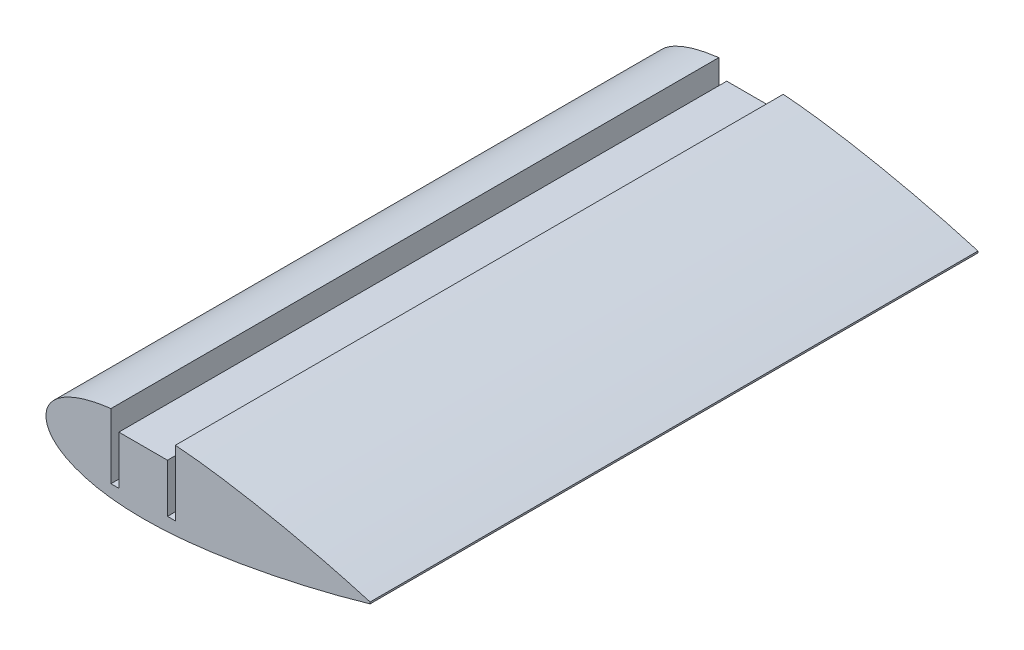
ISO-10303-21;
HEADER;
FILE_DESCRIPTION(('STEP AP214'),'2;1');
FILE_NAME('part.step','',(''),(''),'','','');
FILE_SCHEMA(('AUTOMOTIVE_DESIGN { 1 0 10303 214 1 1 1 1 }'));
ENDSEC;
DATA;
#1=APPLICATION_CONTEXT('core data for automotive mechanical design processes');
#2=APPLICATION_PROTOCOL_DEFINITION('international standard','automotive_design',2000,#1);
#3=PRODUCT_CONTEXT('',#1,'mechanical');
#4=PRODUCT('Part','Part','',(#3));
#5=PRODUCT_RELATED_PRODUCT_CATEGORY('part','',(#4));
#6=PRODUCT_DEFINITION_FORMATION('','',#4);
#7=PRODUCT_DEFINITION_CONTEXT('part definition',#1,'design');
#8=PRODUCT_DEFINITION('design','',#6,#7);
#9=PRODUCT_DEFINITION_SHAPE('','',#8);
#10=(LENGTH_UNIT() NAMED_UNIT(*) SI_UNIT(.MILLI.,.METRE.));
#11=(NAMED_UNIT(*) PLANE_ANGLE_UNIT() SI_UNIT($,.RADIAN.));
#12=(NAMED_UNIT(*) SI_UNIT($,.STERADIAN.) SOLID_ANGLE_UNIT());
#13=UNCERTAINTY_MEASURE_WITH_UNIT(LENGTH_MEASURE(1.E-05),#10,'distance_accuracy_value','');
#14=(GEOMETRIC_REPRESENTATION_CONTEXT(3) GLOBAL_UNCERTAINTY_ASSIGNED_CONTEXT((#13)) GLOBAL_UNIT_ASSIGNED_CONTEXT((#10,
#11,#12)) REPRESENTATION_CONTEXT('',''));
#15=CARTESIAN_POINT('',(0.,0.,0.));
#16=DIRECTION('',(0.,0.,1.));
#17=DIRECTION('',(1.,0.,0.));
#18=AXIS2_PLACEMENT_3D('',#15,#16,#17);
#19=CARTESIAN_POINT('',(55.9989919193493,0.209938863085076,150.));
#20=CARTESIAN_POINT('',(53.4638964966378,0.950455213569446,150.));
#21=CARTESIAN_POINT('',(48.8039042583549,2.23387389684317,150.));
#22=CARTESIAN_POINT('',(42.4289239083546,3.81993488404164,150.));
#23=CARTESIAN_POINT('',(36.7433768309172,5.12087345257297,150.));
#24=CARTESIAN_POINT('',(31.199749361999,6.28724939568446,150.));
#25=CARTESIAN_POINT('',(25.282426202672,7.40748841907212,150.));
#26=CARTESIAN_POINT('',(20.1764843732921,8.24523101459941,150.));
#27=CARTESIAN_POINT('',(14.9796239544358,8.97488730570402,150.));
#28=CARTESIAN_POINT('',(10.821499068855,9.448623319597,150.));
#29=CARTESIAN_POINT('',(6.69735098701538,9.77702289368401,150.));
#30=CARTESIAN_POINT('',(3.68065560441313,9.9396226054484,150.));
#31=CARTESIAN_POINT('',(0.739619612666901,10.0126657259053,150.));
#32=CARTESIAN_POINT('',(-2.10775121270018,9.99002894364164,150.));
#33=CARTESIAN_POINT('',(-4.84394170477697,9.86696098204471,150.));
#34=CARTESIAN_POINT('',(-7.45218804783977,9.64089989695852,150.));
#35=CARTESIAN_POINT('',(-9.91647870541163,9.31063074400066,150.));
#36=CARTESIAN_POINT('',(-12.2217517660549,8.87722299298465,150.));
#37=CARTESIAN_POINT('',(-14.3540217517739,8.3436594333454,150.));
#38=CARTESIAN_POINT('',(-16.3004013447247,7.71434115945919,150.));
#39=CARTESIAN_POINT('',(-18.0493555178327,6.99539951409285,150.));
#40=CARTESIAN_POINT('',(-19.5906051636423,6.19339349001841,150.));
#41=CARTESIAN_POINT('',(-20.9154102376862,5.31556202706807,150.));
#42=CARTESIAN_POINT('',(-22.0158536973899,4.36806482887196,150.));
#43=CARTESIAN_POINT('',(-22.8849211839651,3.3564916522408,150.));
#44=CARTESIAN_POINT('',(-23.5144514570847,2.28497610959955,150.));
#45=CARTESIAN_POINT('',(-23.8953726240987,1.15878899111641,150.));
#46=CARTESIAN_POINT('',(-24.0186796636969,-1.75908521777257E-13,150.));
#47=CARTESIAN_POINT('',(-23.8953726240988,-1.15878899111675,150.));
#48=CARTESIAN_POINT('',(-23.5144514570847,-2.28497610959989,150.));
#49=CARTESIAN_POINT('',(-22.884921183965,-3.35649165224111,150.));
#50=CARTESIAN_POINT('',(-22.0158536973898,-4.36806482887224,150.));
#51=CARTESIAN_POINT('',(-20.915410237686,-5.3155620270683,150.));
#52=CARTESIAN_POINT('',(-19.5906051636421,-6.19339349001866,150.));
#53=CARTESIAN_POINT('',(-18.0493555178326,-6.99539951409303,150.));
#54=CARTESIAN_POINT('',(-16.3004013447245,-7.7143411594593,150.));
#55=CARTESIAN_POINT('',(-14.3540217517738,-8.34365943334548,150.));
#56=CARTESIAN_POINT('',(-12.2217517660546,-8.87722299298468,150.));
#57=CARTESIAN_POINT('',(-9.91647870541153,-9.31063074400058,150.));
#58=CARTESIAN_POINT('',(-7.45218804783928,-9.64089989695837,150.));
#59=CARTESIAN_POINT('',(-4.84394170477671,-9.86696098204449,150.));
#60=CARTESIAN_POINT('',(-2.10775121269992,-9.9900289436414,150.));
#61=CARTESIAN_POINT('',(0.739619612667124,-10.0126657259049,150.));
#62=CARTESIAN_POINT('',(3.68065560441341,-9.93962260544802,150.));
#63=CARTESIAN_POINT('',(7.74070186985012,-9.72078633967261,150.));
#64=CARTESIAN_POINT('',(12.9128329822487,-9.24133423758695,150.));
#65=CARTESIAN_POINT('',(19.1366713132933,-8.41575446947586,150.));
#66=CARTESIAN_POINT('',(25.2824253698515,-7.40744897655412,150.));
#67=CARTESIAN_POINT('',(31.1997526672966,-6.28725230429911,150.));
#68=CARTESIAN_POINT('',(37.5171609466784,-4.95809921986488,150.));
#69=CARTESIAN_POINT('',(44.7425708724751,-3.27585727198836,150.));
#70=CARTESIAN_POINT('',(51.057566094569,-1.62626062854624,150.));
#71=CARTESIAN_POINT('',(54.9450257220016,-0.517808616230064,150.));
#72=CARTESIAN_POINT('',(55.9579115196256,-0.221938690548135,150.));
#73=CARTESIAN_POINT('',(55.9989919193493,-0.209938863083146,150.));
#74=B_SPLINE_CURVE_WITH_KNOTS('',3,(#19,#20,#21,#22,#23,#24,#25,#26,#27,#28,#29,#30,#31,#32,#33,
#34,#35,#36,#37,#38,#39,#40,#41,#42,#43,#44,#45,#46,#47,#48,#49,#50,#51,#52,#53,#54,#55,#56,#57,
#58,#59,#60,#61,#62,#63,#64,#65,#66,#67,#68,#69,#70,#71,#72,#73),.UNSPECIFIED.,.F.,.F.,(4,1,1,1,
1,1,1,1,1,1,1,1,1,1,1,1,1,1,1,1,1,1,1,1,1,1,1,1,1,1,1,1,1,1,1,1,1,1,1,1,1,1,1,1,1,1,1,1,1,1,1,1,
4),(0.,0.046554702548103,0.0851933723553801,0.115793222339596,0.149362634078918,0.1850479898127,
0.221946042476896,0.240561294663547,0.277549679499533,0.295701184971201,0.313482549842361,
0.330796889450606,0.347551895237421,0.36366584186233,0.379065349030513,0.393686065347915,
0.407475418245897,0.42039193375361,0.432405656844922,0.443502805927447,0.45368642125852,
0.462984388050073,0.471455944432899,0.479204464756735,0.48638826860332,0.493228973887645,0.5,
0.506771026112355,0.51361173139668,0.520795535243265,0.528544055567101,0.537015611949927,
0.54631357874148,0.556497194072553,0.567594343155078,0.579608066246389,0.592524581754103,
0.606313934652085,0.620934650969486,0.63633415813767,0.652448104762579,0.669203110549394,
0.686517450157639,0.704298815028799,0.740866340835607,0.778053957523103,0.8149520101873,
0.850637365921082,0.884206777660403,0.928744289385696,0.981399281225805,0.999245596133163,1.),.UNSPECIFIED.);
#75=DIRECTION('',(0.,0.,-1.));
#76=VECTOR('',#75,1.);
#77=SURFACE_OF_LINEAR_EXTRUSION('',#74,#76);
#78=CARTESIAN_POINT('',(55.9989919193493,0.209938863085076,0.));
#79=CARTESIAN_POINT('',(53.4638964966378,0.950455213569446,0.));
#80=CARTESIAN_POINT('',(48.8039042583549,2.23387389684317,0.));
#81=CARTESIAN_POINT('',(42.4289239083546,3.81993488404164,0.));
#82=CARTESIAN_POINT('',(36.7433768309172,5.12087345257297,0.));
#83=CARTESIAN_POINT('',(31.199749361999,6.28724939568446,0.));
#84=CARTESIAN_POINT('',(25.282426202672,7.40748841907212,0.));
#85=CARTESIAN_POINT('',(20.1764843732921,8.24523101459941,0.));
#86=CARTESIAN_POINT('',(14.9796239544358,8.97488730570402,0.));
#87=CARTESIAN_POINT('',(10.821499068855,9.448623319597,0.));
#88=CARTESIAN_POINT('',(6.69735098701538,9.77702289368401,0.));
#89=CARTESIAN_POINT('',(3.68065560441313,9.9396226054484,0.));
#90=CARTESIAN_POINT('',(0.739619612666901,10.0126657259053,0.));
#91=CARTESIAN_POINT('',(-2.10775121270018,9.99002894364164,0.));
#92=CARTESIAN_POINT('',(-4.84394170477697,9.86696098204471,0.));
#93=CARTESIAN_POINT('',(-7.45218804783977,9.64089989695852,0.));
#94=CARTESIAN_POINT('',(-9.91647870541163,9.31063074400066,0.));
#95=CARTESIAN_POINT('',(-12.2217517660549,8.87722299298465,0.));
#96=CARTESIAN_POINT('',(-14.3540217517739,8.3436594333454,0.));
#97=CARTESIAN_POINT('',(-16.3004013447247,7.71434115945919,0.));
#98=CARTESIAN_POINT('',(-18.0493555178327,6.99539951409285,0.));
#99=CARTESIAN_POINT('',(-19.5906051636423,6.19339349001841,0.));
#100=CARTESIAN_POINT('',(-20.9154102376862,5.31556202706807,0.));
#101=CARTESIAN_POINT('',(-22.0158536973899,4.36806482887196,0.));
#102=CARTESIAN_POINT('',(-22.8849211839651,3.3564916522408,0.));
#103=CARTESIAN_POINT('',(-23.5144514570847,2.28497610959955,0.));
#104=CARTESIAN_POINT('',(-23.8953726240987,1.15878899111641,0.));
#105=CARTESIAN_POINT('',(-24.0186796636969,-1.75908521777257E-13,0.));
#106=CARTESIAN_POINT('',(-23.8953726240988,-1.15878899111675,0.));
#107=CARTESIAN_POINT('',(-23.5144514570847,-2.28497610959989,0.));
#108=CARTESIAN_POINT('',(-22.884921183965,-3.35649165224111,0.));
#109=CARTESIAN_POINT('',(-22.0158536973898,-4.36806482887224,0.));
#110=CARTESIAN_POINT('',(-20.915410237686,-5.3155620270683,0.));
#111=CARTESIAN_POINT('',(-19.5906051636421,-6.19339349001866,0.));
#112=CARTESIAN_POINT('',(-18.0493555178326,-6.99539951409303,0.));
#113=CARTESIAN_POINT('',(-16.3004013447245,-7.7143411594593,0.));
#114=CARTESIAN_POINT('',(-14.3540217517738,-8.34365943334548,0.));
#115=CARTESIAN_POINT('',(-12.2217517660546,-8.87722299298468,0.));
#116=CARTESIAN_POINT('',(-9.91647870541153,-9.31063074400058,0.));
#117=CARTESIAN_POINT('',(-7.45218804783928,-9.64089989695837,0.));
#118=CARTESIAN_POINT('',(-4.84394170477671,-9.86696098204449,0.));
#119=CARTESIAN_POINT('',(-2.10775121269992,-9.9900289436414,0.));
#120=CARTESIAN_POINT('',(0.739619612667124,-10.0126657259049,0.));
#121=CARTESIAN_POINT('',(3.68065560441341,-9.93962260544802,0.));
#122=CARTESIAN_POINT('',(7.74070186985012,-9.72078633967261,0.));
#123=CARTESIAN_POINT('',(12.9128329822487,-9.24133423758695,0.));
#124=CARTESIAN_POINT('',(19.1366713132933,-8.41575446947586,0.));
#125=CARTESIAN_POINT('',(25.2824253698515,-7.40744897655412,0.));
#126=CARTESIAN_POINT('',(31.1997526672966,-6.28725230429911,0.));
#127=CARTESIAN_POINT('',(37.5171609466784,-4.95809921986488,0.));
#128=CARTESIAN_POINT('',(44.7425708724751,-3.27585727198836,0.));
#129=CARTESIAN_POINT('',(51.057566094569,-1.62626062854624,0.));
#130=CARTESIAN_POINT('',(54.9450257220016,-0.517808616230064,0.));
#131=CARTESIAN_POINT('',(55.9579115196256,-0.221938690548135,0.));
#132=CARTESIAN_POINT('',(55.9989919193493,-0.209938863083146,0.));
#133=B_SPLINE_CURVE_WITH_KNOTS('',3,(#78,#79,#80,#81,#82,#83,#84,#85,#86,#87,#88,#89,#90,#91,
#92,#93,#94,#95,#96,#97,#98,#99,#100,#101,#102,#103,#104,#105,#106,#107,#108,#109,#110,#111,
#112,#113,#114,#115,#116,#117,#118,#119,#120,#121,#122,#123,#124,#125,#126,#127,#128,#129,#130,
#131,#132),.UNSPECIFIED.,.F.,.F.,(4,1,1,1,1,1,1,1,1,1,1,1,1,1,1,1,1,1,1,1,1,1,1,1,1,1,1,1,1,1,1,
1,1,1,1,1,1,1,1,1,1,1,1,1,1,1,1,1,1,1,1,1,4),(0.,0.046554702548103,0.0851933723553801,
0.115793222339596,0.149362634078918,0.1850479898127,0.221946042476896,0.240561294663547,
0.277549679499533,0.295701184971201,0.313482549842361,0.330796889450606,0.347551895237421,
0.36366584186233,0.379065349030513,0.393686065347915,0.407475418245897,0.42039193375361,
0.432405656844922,0.443502805927447,0.45368642125852,0.462984388050073,0.471455944432899,
0.479204464756735,0.48638826860332,0.493228973887645,0.5,0.506771026112355,0.51361173139668,
0.520795535243265,0.528544055567101,0.537015611949927,0.54631357874148,0.556497194072553,
0.567594343155078,0.579608066246389,0.592524581754103,0.606313934652085,0.620934650969486,
0.63633415813767,0.652448104762579,0.669203110549394,0.686517450157639,0.704298815028799,
0.740866340835607,0.778053957523103,0.8149520101873,0.850637365921082,0.884206777660403,
0.928744289385696,0.981399281225805,0.999245596133163,1.),.UNSPECIFIED.);
#134=CARTESIAN_POINT('',(55.9989919193493,0.209938863085006,0.));
#135=VERTEX_POINT('',#134);
#136=CARTESIAN_POINT('',(7.95,9.67376392846105,0.));
#137=VERTEX_POINT('',#136);
#138=EDGE_CURVE('E91',#135,#137,#133,.T.);
#139=ORIENTED_EDGE('',*,*,#138,.T.);
#140=DIRECTION('',(0.,0.,-1.));
#141=VECTOR('',#140,1.);
#142=CARTESIAN_POINT('',(7.95,9.67376392846105,75.0005));
#143=LINE('',#142,#141);
#144=CARTESIAN_POINT('',(7.95000022217772,9.67320604176941,150.));
#145=VERTEX_POINT('',#144);
#146=EDGE_CURVE('E305',#145,#137,#143,.T.);
#147=ORIENTED_EDGE('',*,*,#146,.F.);
#148=CARTESIAN_POINT('',(7.95004296781648,9.67376061658568,150.));
#149=CARTESIAN_POINT('',(8.55206981624657,9.62735745972923,150.));
#150=CARTESIAN_POINT('',(11.2447846059229,9.40039831227111,150.));
#151=CARTESIAN_POINT('',(14.9796239544358,8.97488730570402,150.));
#152=CARTESIAN_POINT('',(20.1764843732921,8.24523101459941,150.));
#153=CARTESIAN_POINT('',(25.282426202672,7.40748841907212,150.));
#154=CARTESIAN_POINT('',(31.199749361999,6.28724939568446,150.));
#155=CARTESIAN_POINT('',(36.7433768309172,5.12087345257297,150.));
#156=CARTESIAN_POINT('',(42.4289239083546,3.81993488404164,150.));
#157=CARTESIAN_POINT('',(48.8039042583549,2.23387389684317,150.));
#158=CARTESIAN_POINT('',(53.4638964966378,0.950455213569446,150.));
#159=CARTESIAN_POINT('',(55.9989919193493,0.209938863085076,150.));
#160=B_SPLINE_CURVE_WITH_KNOTS('',3,(#148,#149,#150,#151,#152,#153,#154,#155,#156,#157,#158,
#159),.UNSPECIFIED.,.F.,.F.,(4,1,1,1,1,1,1,1,1,4),(0.,0.0106434373012104,0.0476318221371959,
0.0662470743238466,0.103145126988043,0.138830482721825,0.172399894461147,0.202999744445363,
0.24163841425264,0.288193116800743),.UNSPECIFIED.);
#161=CARTESIAN_POINT('',(55.9989919193493,0.209938863085006,150.));
#162=VERTEX_POINT('',#161);
#163=EDGE_CURVE('E97',#162,#145,#160,.F.);
#164=ORIENTED_EDGE('',*,*,#163,.F.);
#165=DIRECTION('',(0.,0.,-1.));
#166=VECTOR('',#165,1.);
#167=CARTESIAN_POINT('',(55.9989919193493,0.209938863085006,150.));
#168=LINE('',#167,#166);
#169=EDGE_CURVE('E53',#162,#135,#168,.T.);
#170=ORIENTED_EDGE('',*,*,#169,.T.);
#171=EDGE_LOOP('',(#139,#147,#164,#170));
#172=FACE_BOUND('',#171,.T.);
#173=ADVANCED_FACE('F41',(#172),#77,.F.);
#174=CARTESIAN_POINT('',(55.9989919193493,-0.209938863083146,150.));
#175=CARTESIAN_POINT('',(55.9579115196256,-0.221938690548135,150.));
#176=CARTESIAN_POINT('',(54.9450257220016,-0.517808616230064,150.));
#177=CARTESIAN_POINT('',(51.057566094569,-1.62626062854624,150.));
#178=CARTESIAN_POINT('',(44.7425708724751,-3.27585727198836,150.));
#179=CARTESIAN_POINT('',(37.5171609466784,-4.95809921986488,150.));
#180=CARTESIAN_POINT('',(31.1997526672966,-6.28725230429911,150.));
#181=CARTESIAN_POINT('',(25.2824253698515,-7.40744897655412,150.));
#182=CARTESIAN_POINT('',(19.1366713132933,-8.41575446947586,150.));
#183=CARTESIAN_POINT('',(12.9128329822487,-9.24133423758695,150.));
#184=CARTESIAN_POINT('',(7.74070186985012,-9.72078633967261,150.));
#185=CARTESIAN_POINT('',(3.68065560441341,-9.93962260544802,150.));
#186=CARTESIAN_POINT('',(0.739619612667124,-10.0126657259049,150.));
#187=CARTESIAN_POINT('',(-2.10775121269992,-9.9900289436414,150.));
#188=CARTESIAN_POINT('',(-4.84394170477671,-9.86696098204449,150.));
#189=CARTESIAN_POINT('',(-7.45218804783928,-9.64089989695837,150.));
#190=CARTESIAN_POINT('',(-9.91647870541153,-9.31063074400058,150.));
#191=CARTESIAN_POINT('',(-12.2217517660546,-8.87722299298468,150.));
#192=CARTESIAN_POINT('',(-14.3540217517738,-8.34365943334548,150.));
#193=CARTESIAN_POINT('',(-16.3004013447245,-7.7143411594593,150.));
#194=CARTESIAN_POINT('',(-18.0493555178326,-6.99539951409303,150.));
#195=CARTESIAN_POINT('',(-19.5906051636421,-6.19339349001866,150.));
#196=CARTESIAN_POINT('',(-20.915410237686,-5.3155620270683,150.));
#197=CARTESIAN_POINT('',(-22.0158536973898,-4.36806482887224,150.));
#198=CARTESIAN_POINT('',(-22.884921183965,-3.35649165224111,150.));
#199=CARTESIAN_POINT('',(-23.5144514570847,-2.28497610959989,150.));
#200=CARTESIAN_POINT('',(-23.8953726240988,-1.15878899111675,150.));
#201=CARTESIAN_POINT('',(-24.0186796636969,-1.75908521777257E-13,150.));
#202=CARTESIAN_POINT('',(-23.8953726240987,1.15878899111641,150.));
#203=CARTESIAN_POINT('',(-23.5144514570847,2.28497610959955,150.));
#204=CARTESIAN_POINT('',(-22.8849211839651,3.3564916522408,150.));
#205=CARTESIAN_POINT('',(-22.0158536973899,4.36806482887196,150.));
#206=CARTESIAN_POINT('',(-20.9154102376862,5.31556202706807,150.));
#207=CARTESIAN_POINT('',(-19.5906051636423,6.19339349001841,150.));
#208=CARTESIAN_POINT('',(-18.0493555178327,6.99539951409285,150.));
#209=CARTESIAN_POINT('',(-16.3004013447247,7.71434115945919,150.));
#210=CARTESIAN_POINT('',(-14.3540217517739,8.3436594333454,150.));
#211=CARTESIAN_POINT('',(-12.2217517660549,8.87722299298465,150.));
#212=CARTESIAN_POINT('',(-10.0669225668256,9.2823462267594,150.));
#213=CARTESIAN_POINT('',(-8.62170436038093,9.48338797999524,150.));
#214=CARTESIAN_POINT('',(-7.94998790313957,9.56370201604713,150.));
#215=B_SPLINE_CURVE_WITH_KNOTS('',3,(#174,#175,#176,#177,#178,#179,#180,#181,#182,#183,#184,
#185,#186,#187,#188,#189,#190,#191,#192,#193,#194,#195,#196,#197,#198,#199,#200,#201,#202,#203,
#204,#205,#206,#207,#208,#209,#210,#211,#212,#213,#214),.UNSPECIFIED.,.F.,.F.,(4,1,1,1,1,1,1,1,
1,1,1,1,1,1,1,1,1,1,1,1,1,1,1,1,1,1,1,1,1,1,1,1,1,1,1,1,1,1,4),(0.381762353168956,
0.382516757035792,0.40036307194315,0.453018063783259,0.497555575508552,0.531124987247873,
0.566810342981656,0.603708395645852,0.640896012333348,0.677463538140157,0.695244903011317,
0.712559242619562,0.729314248406377,0.745428195031286,0.760827702199469,0.775448418516871,
0.789237771414852,0.802154286922566,0.814168010013878,0.825265159096403,0.835448774427476,
0.844746741219029,0.853218297601854,0.860966817925691,0.868150621772276,0.8749913270566,
0.881762353168956,0.888533379281311,0.895374084565636,0.902557888412221,0.910306408736057,
0.918777965118882,0.928075931910435,0.938259547241509,0.949356696324034,0.961370419415345,
0.974286934923059,0.988076287821041,1.),.UNSPECIFIED.);
#216=CARTESIAN_POINT('',(-7.9499999621112,9.56378591811171,150.000165217242));
#217=VERTEX_POINT('',#216);
#218=CARTESIAN_POINT('',(55.9989919193493,-0.209938863083216,150.));
#219=VERTEX_POINT('',#218);
#220=EDGE_CURVE('E90',#217,#219,#215,.F.);
#221=ORIENTED_EDGE('',*,*,#220,.F.);
#222=DIRECTION('',(0.,0.,-1.));
#223=VECTOR('',#222,1.);
#224=CARTESIAN_POINT('',(-7.94999999999999,9.56370056967996,75.0005));
#225=LINE('',#224,#223);
#226=CARTESIAN_POINT('',(-7.94999999999999,9.56370056967996,0.));
#227=VERTEX_POINT('',#226);
#228=EDGE_CURVE('E306',#217,#227,#225,.T.);
#229=ORIENTED_EDGE('',*,*,#228,.T.);
#230=CARTESIAN_POINT('',(55.9989919193493,-0.209938863083216,0.));
#231=VERTEX_POINT('',#230);
#232=EDGE_CURVE('E105',#227,#231,#133,.T.);
#233=ORIENTED_EDGE('',*,*,#232,.T.);
#234=DIRECTION('',(0.,0.,-1.));
#235=VECTOR('',#234,1.);
#236=CARTESIAN_POINT('',(55.9989919193493,-0.209938863083216,150.));
#237=LINE('',#236,#235);
#238=EDGE_CURVE('E11',#219,#231,#237,.T.);
#239=ORIENTED_EDGE('',*,*,#238,.F.);
#240=EDGE_LOOP('',(#221,#229,#233,#239));
#241=FACE_BOUND('',#240,.T.);
#242=ADVANCED_FACE('F43',(#241),#77,.F.);
#243=CARTESIAN_POINT('',(55.9989919193493,0.209938863085006,150.));
#244=DIRECTION('',(-1.,0.,0.));
#245=DIRECTION('',(0.,0.,1.));
#246=AXIS2_PLACEMENT_3D('',#243,#244,#245);
#247=PLANE('',#246);
#248=DIRECTION('',(0.,1.,0.));
#249=VECTOR('',#248,1.);
#250=CARTESIAN_POINT('',(55.9989919193493,0.209938863085006,0.));
#251=LINE('',#250,#249);
#252=EDGE_CURVE('E82',#231,#135,#251,.T.);
#253=ORIENTED_EDGE('',*,*,#252,.T.);
#254=ORIENTED_EDGE('',*,*,#169,.F.);
#255=DIRECTION('',(0.,1.,0.));
#256=VECTOR('',#255,1.);
#257=CARTESIAN_POINT('',(55.9989919193493,0.209938863085006,150.));
#258=LINE('',#257,#256);
#259=EDGE_CURVE('E70',#219,#162,#258,.T.);
#260=ORIENTED_EDGE('',*,*,#259,.F.);
#261=ORIENTED_EDGE('',*,*,#238,.T.);
#262=EDGE_LOOP('',(#253,#254,#260,#261));
#263=FACE_BOUND('',#262,.T.);
#264=ADVANCED_FACE('F84',(#263),#247,.F.);
#265=CARTESIAN_POINT('',(-23.9777178269784,-1.93472177114595E-13,150.));
#266=DIRECTION('',(0.,0.,-1.));
#267=DIRECTION('',(-1.,0.,0.));
#268=AXIS2_PLACEMENT_3D('',#265,#266,#267);
#269=PLANE('',#268);
#270=ORIENTED_EDGE('',*,*,#163,.T.);
#271=DIRECTION('',(0.,1.,0.));
#272=VECTOR('',#271,1.);
#273=CARTESIAN_POINT('',(7.95,-6.49999999999986,150.));
#274=LINE('',#273,#272);
#275=CARTESIAN_POINT('',(7.95,-6.49999999999986,150.));
#276=VERTEX_POINT('',#275);
#277=EDGE_CURVE('E275',#276,#145,#274,.T.);
#278=ORIENTED_EDGE('',*,*,#277,.F.);
#279=DIRECTION('',(1.,0.,0.));
#280=VECTOR('',#279,1.);
#281=CARTESIAN_POINT('',(6.,-6.49999999999986,150.));
#282=LINE('',#281,#280);
#283=CARTESIAN_POINT('',(6.,-6.49999999999986,150.));
#284=VERTEX_POINT('',#283);
#285=EDGE_CURVE('E272',#284,#276,#282,.T.);
#286=ORIENTED_EDGE('',*,*,#285,.F.);
#287=DIRECTION('',(0.,-1.,0.));
#288=VECTOR('',#287,1.);
#289=CARTESIAN_POINT('',(6.,-6.49999999999986,150.));
#290=LINE('',#289,#288);
#291=CARTESIAN_POINT('',(6.,5.50000000000014,150.));
#292=VERTEX_POINT('',#291);
#293=EDGE_CURVE('E263',#292,#284,#290,.T.);
#294=ORIENTED_EDGE('',*,*,#293,.F.);
#295=DIRECTION('',(1.,0.,0.));
#296=VECTOR('',#295,1.);
#297=CARTESIAN_POINT('',(6.,5.50000000000014,150.));
#298=LINE('',#297,#296);
#299=CARTESIAN_POINT('',(-6.,5.50000000000014,150.));
#300=VERTEX_POINT('',#299);
#301=EDGE_CURVE('E260',#300,#292,#298,.T.);
#302=ORIENTED_EDGE('',*,*,#301,.F.);
#303=DIRECTION('',(0.,1.,0.));
#304=VECTOR('',#303,1.);
#305=CARTESIAN_POINT('',(-6.,-6.49999999999986,150.));
#306=LINE('',#305,#304);
#307=CARTESIAN_POINT('',(-6.,-6.49999999999986,150.));
#308=VERTEX_POINT('',#307);
#309=EDGE_CURVE('E253',#308,#300,#306,.T.);
#310=ORIENTED_EDGE('',*,*,#309,.F.);
#311=DIRECTION('',(1.,0.,0.));
#312=VECTOR('',#311,1.);
#313=CARTESIAN_POINT('',(-6.,-6.49999999999986,150.));
#314=LINE('',#313,#312);
#315=CARTESIAN_POINT('',(-7.95,-6.49999999999986,150.));
#316=VERTEX_POINT('',#315);
#317=EDGE_CURVE('E107',#316,#308,#314,.T.);
#318=ORIENTED_EDGE('',*,*,#317,.F.);
#319=DIRECTION('',(0.,-1.,0.));
#320=VECTOR('',#319,1.);
#321=CARTESIAN_POINT('',(-7.95,-6.49999999999986,150.));
#322=LINE('',#321,#320);
#323=EDGE_CURVE('E261',#217,#316,#322,.T.);
#324=ORIENTED_EDGE('',*,*,#323,.F.);
#325=ORIENTED_EDGE('',*,*,#220,.T.);
#326=ORIENTED_EDGE('',*,*,#259,.T.);
#327=EDGE_LOOP('',(#270,#278,#286,#294,#302,#310,#318,#324,#325,#326));
#328=FACE_BOUND('',#327,.T.);
#329=ADVANCED_FACE('F124',(#328),#269,.F.);
#330=CARTESIAN_POINT('',(-23.9777178269784,-1.93472177114595E-13,0.));
#331=DIRECTION('',(0.,0.,-1.));
#332=DIRECTION('',(-1.,0.,0.));
#333=AXIS2_PLACEMENT_3D('',#330,#331,#332);
#334=PLANE('',#333);
#335=DIRECTION('',(0.,-1.,0.));
#336=VECTOR('',#335,1.);
#337=CARTESIAN_POINT('',(7.95,-6.49999999999986,0.));
#338=LINE('',#337,#336);
#339=CARTESIAN_POINT('',(7.95,-6.49999999999986,0.));
#340=VERTEX_POINT('',#339);
#341=EDGE_CURVE('E104',#137,#340,#338,.T.);
#342=ORIENTED_EDGE('',*,*,#341,.F.);
#343=ORIENTED_EDGE('',*,*,#138,.F.);
#344=ORIENTED_EDGE('',*,*,#252,.F.);
#345=ORIENTED_EDGE('',*,*,#232,.F.);
#346=DIRECTION('',(0.,1.,0.));
#347=VECTOR('',#346,1.);
#348=CARTESIAN_POINT('',(-7.95,-6.49999999999986,0.));
#349=LINE('',#348,#347);
#350=CARTESIAN_POINT('',(-7.95,-6.49999999999986,0.));
#351=VERTEX_POINT('',#350);
#352=EDGE_CURVE('E283',#351,#227,#349,.T.);
#353=ORIENTED_EDGE('',*,*,#352,.F.);
#354=DIRECTION('',(-1.,0.,0.));
#355=VECTOR('',#354,1.);
#356=CARTESIAN_POINT('',(-6.,-6.49999999999986,0.));
#357=LINE('',#356,#355);
#358=CARTESIAN_POINT('',(-6.,-6.49999999999986,0.));
#359=VERTEX_POINT('',#358);
#360=EDGE_CURVE('E281',#359,#351,#357,.T.);
#361=ORIENTED_EDGE('',*,*,#360,.F.);
#362=DIRECTION('',(0.,-1.,0.));
#363=VECTOR('',#362,1.);
#364=CARTESIAN_POINT('',(-6.,-6.49999999999986,0.));
#365=LINE('',#364,#363);
#366=CARTESIAN_POINT('',(-6.,5.50000000000014,0.));
#367=VERTEX_POINT('',#366);
#368=EDGE_CURVE('E61',#367,#359,#365,.T.);
#369=ORIENTED_EDGE('',*,*,#368,.F.);
#370=DIRECTION('',(-1.,0.,0.));
#371=VECTOR('',#370,1.);
#372=CARTESIAN_POINT('',(6.,5.50000000000014,0.));
#373=LINE('',#372,#371);
#374=CARTESIAN_POINT('',(6.,5.50000000000014,0.));
#375=VERTEX_POINT('',#374);
#376=EDGE_CURVE('E255',#375,#367,#373,.T.);
#377=ORIENTED_EDGE('',*,*,#376,.F.);
#378=DIRECTION('',(0.,1.,0.));
#379=VECTOR('',#378,1.);
#380=CARTESIAN_POINT('',(6.,-6.49999999999986,0.));
#381=LINE('',#380,#379);
#382=CARTESIAN_POINT('',(6.,-6.49999999999986,0.));
#383=VERTEX_POINT('',#382);
#384=EDGE_CURVE('E290',#383,#375,#381,.T.);
#385=ORIENTED_EDGE('',*,*,#384,.F.);
#386=DIRECTION('',(-1.,0.,0.));
#387=VECTOR('',#386,1.);
#388=CARTESIAN_POINT('',(6.,-6.49999999999986,0.));
#389=LINE('',#388,#387);
#390=EDGE_CURVE('E287',#340,#383,#389,.T.);
#391=ORIENTED_EDGE('',*,*,#390,.F.);
#392=EDGE_LOOP('',(#342,#343,#344,#345,#353,#361,#369,#377,#385,#391));
#393=FACE_BOUND('',#392,.T.);
#394=ADVANCED_FACE('F101',(#393),#334,.T.);
#395=CARTESIAN_POINT('',(-6.,-6.49999999999986,150.001));
#396=DIRECTION('',(1.,0.,0.));
#397=DIRECTION('',(0.,1.,0.));
#398=AXIS2_PLACEMENT_3D('',#395,#396,#397);
#399=PLANE('',#398);
#400=ORIENTED_EDGE('',*,*,#309,.T.);
#401=DIRECTION('',(0.,0.,-1.));
#402=VECTOR('',#401,1.);
#403=CARTESIAN_POINT('',(-6.,5.50000000000014,150.001));
#404=LINE('',#403,#402);
#405=EDGE_CURVE('E251',#300,#367,#404,.T.);
#406=ORIENTED_EDGE('',*,*,#405,.T.);
#407=ORIENTED_EDGE('',*,*,#368,.T.);
#408=DIRECTION('',(0.,0.,-1.));
#409=VECTOR('',#408,1.);
#410=CARTESIAN_POINT('',(-6.,-6.49999999999986,150.001));
#411=LINE('',#410,#409);
#412=EDGE_CURVE('E242',#308,#359,#411,.T.);
#413=ORIENTED_EDGE('',*,*,#412,.F.);
#414=EDGE_LOOP('',(#400,#406,#407,#413));
#415=FACE_BOUND('',#414,.T.);
#416=ADVANCED_FACE('F134',(#415),#399,.F.);
#417=CARTESIAN_POINT('',(6.,5.50000000000014,150.001));
#418=DIRECTION('',(0.,-1.,0.));
#419=DIRECTION('',(1.,0.,0.));
#420=AXIS2_PLACEMENT_3D('',#417,#418,#419);
#421=PLANE('',#420);
#422=ORIENTED_EDGE('',*,*,#301,.T.);
#423=DIRECTION('',(0.,0.,-1.));
#424=VECTOR('',#423,1.);
#425=CARTESIAN_POINT('',(6.,5.50000000000014,150.001));
#426=LINE('',#425,#424);
#427=EDGE_CURVE('E296',#292,#375,#426,.T.);
#428=ORIENTED_EDGE('',*,*,#427,.T.);
#429=ORIENTED_EDGE('',*,*,#376,.T.);
#430=ORIENTED_EDGE('',*,*,#405,.F.);
#431=EDGE_LOOP('',(#422,#428,#429,#430));
#432=FACE_BOUND('',#431,.T.);
#433=ADVANCED_FACE('F177',(#432),#421,.F.);
#434=CARTESIAN_POINT('',(6.,-6.49999999999986,150.001));
#435=DIRECTION('',(-1.,0.,0.));
#436=DIRECTION('',(0.,-1.,0.));
#437=AXIS2_PLACEMENT_3D('',#434,#435,#436);
#438=PLANE('',#437);
#439=ORIENTED_EDGE('',*,*,#293,.T.);
#440=DIRECTION('',(0.,0.,-1.));
#441=VECTOR('',#440,1.);
#442=CARTESIAN_POINT('',(6.,-6.49999999999986,150.001));
#443=LINE('',#442,#441);
#444=EDGE_CURVE('E299',#284,#383,#443,.T.);
#445=ORIENTED_EDGE('',*,*,#444,.T.);
#446=ORIENTED_EDGE('',*,*,#384,.T.);
#447=ORIENTED_EDGE('',*,*,#427,.F.);
#448=EDGE_LOOP('',(#439,#445,#446,#447));
#449=FACE_BOUND('',#448,.T.);
#450=ADVANCED_FACE('F185',(#449),#438,.F.);
#451=CARTESIAN_POINT('',(6.,-6.49999999999986,150.001));
#452=DIRECTION('',(0.,-1.,0.));
#453=DIRECTION('',(0.,0.,-1.));
#454=AXIS2_PLACEMENT_3D('',#451,#452,#453);
#455=PLANE('',#454);
#456=ORIENTED_EDGE('',*,*,#285,.T.);
#457=DIRECTION('',(0.,0.,-1.));
#458=VECTOR('',#457,1.);
#459=CARTESIAN_POINT('',(7.95,-6.49999999999986,150.001));
#460=LINE('',#459,#458);
#461=EDGE_CURVE('E302',#276,#340,#460,.T.);
#462=ORIENTED_EDGE('',*,*,#461,.T.);
#463=ORIENTED_EDGE('',*,*,#390,.T.);
#464=ORIENTED_EDGE('',*,*,#444,.F.);
#465=EDGE_LOOP('',(#456,#462,#463,#464));
#466=FACE_BOUND('',#465,.T.);
#467=ADVANCED_FACE('F195',(#466),#455,.F.);
#468=CARTESIAN_POINT('',(7.95,-6.49999999999986,150.001));
#469=DIRECTION('',(1.,0.,0.));
#470=DIRECTION('',(0.,1.,0.));
#471=AXIS2_PLACEMENT_3D('',#468,#469,#470);
#472=PLANE('',#471);
#473=ORIENTED_EDGE('',*,*,#277,.T.);
#474=ORIENTED_EDGE('',*,*,#146,.T.);
#475=ORIENTED_EDGE('',*,*,#341,.T.);
#476=ORIENTED_EDGE('',*,*,#461,.F.);
#477=EDGE_LOOP('',(#473,#474,#475,#476));
#478=FACE_BOUND('',#477,.T.);
#479=ADVANCED_FACE('F205',(#478),#472,.F.);
#480=CARTESIAN_POINT('',(-7.95,-6.49999999999986,150.001));
#481=DIRECTION('',(-1.,0.,0.));
#482=DIRECTION('',(0.,-1.,0.));
#483=AXIS2_PLACEMENT_3D('',#480,#481,#482);
#484=PLANE('',#483);
#485=ORIENTED_EDGE('',*,*,#323,.T.);
#486=DIRECTION('',(0.,0.,-1.));
#487=VECTOR('',#486,1.);
#488=CARTESIAN_POINT('',(-7.95,-6.49999999999986,150.001));
#489=LINE('',#488,#487);
#490=EDGE_CURVE('E246',#316,#351,#489,.T.);
#491=ORIENTED_EDGE('',*,*,#490,.T.);
#492=ORIENTED_EDGE('',*,*,#352,.T.);
#493=ORIENTED_EDGE('',*,*,#228,.F.);
#494=EDGE_LOOP('',(#485,#491,#492,#493));
#495=FACE_BOUND('',#494,.T.);
#496=ADVANCED_FACE('F215',(#495),#484,.F.);
#497=CARTESIAN_POINT('',(-6.,-6.49999999999986,150.001));
#498=DIRECTION('',(0.,-1.,0.));
#499=DIRECTION('',(0.,0.,-1.));
#500=AXIS2_PLACEMENT_3D('',#497,#498,#499);
#501=PLANE('',#500);
#502=ORIENTED_EDGE('',*,*,#317,.T.);
#503=ORIENTED_EDGE('',*,*,#412,.T.);
#504=ORIENTED_EDGE('',*,*,#360,.T.);
#505=ORIENTED_EDGE('',*,*,#490,.F.);
#506=EDGE_LOOP('',(#502,#503,#504,#505));
#507=FACE_BOUND('',#506,.T.);
#508=ADVANCED_FACE('F225',(#507),#501,.F.);
#509=CLOSED_SHELL('',(#173,#242,#264,#329,#394,#416,#433,#450,#467,#479,#496,#508));
#510=MANIFOLD_SOLID_BREP('B2',#509);
#511=ADVANCED_BREP_SHAPE_REPRESENTATION('',(#18,#510),#14);
#512=SHAPE_DEFINITION_REPRESENTATION(#9,#511);
ENDSEC;
END-ISO-10303-21;
